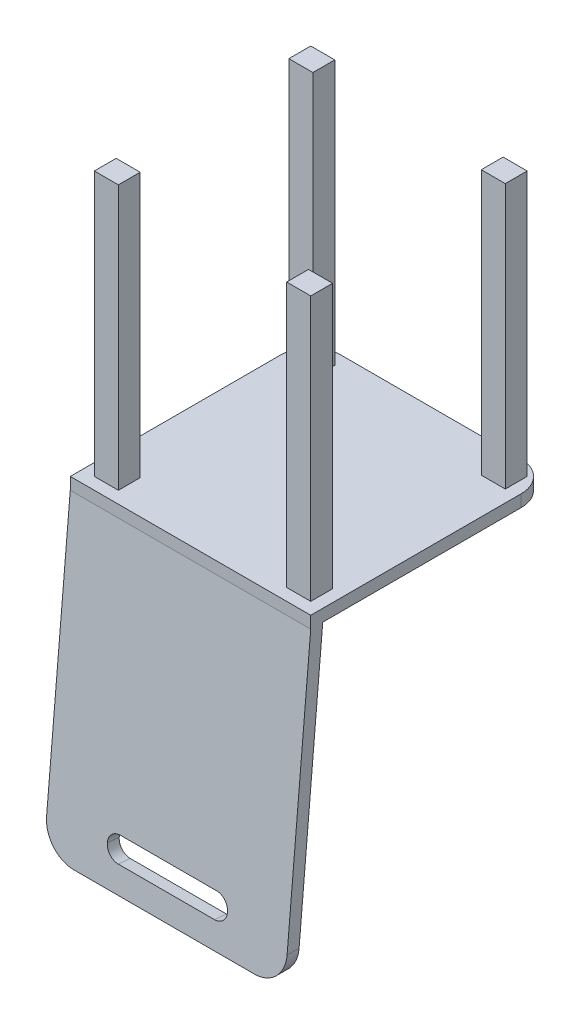
ISO-10303-21;
HEADER;
FILE_DESCRIPTION(('STEP AP214'),'2;1');
FILE_NAME('part.step','',(''),(''),'','','');
FILE_SCHEMA(('AUTOMOTIVE_DESIGN { 1 0 10303 214 1 1 1 1 }'));
ENDSEC;
DATA;
#1=APPLICATION_CONTEXT('core data for automotive mechanical design processes');
#2=APPLICATION_PROTOCOL_DEFINITION('international standard','automotive_design',2000,#1);
#3=PRODUCT_CONTEXT('',#1,'mechanical');
#4=PRODUCT('Part','Part','',(#3));
#5=PRODUCT_RELATED_PRODUCT_CATEGORY('part','',(#4));
#6=PRODUCT_DEFINITION_FORMATION('','',#4);
#7=PRODUCT_DEFINITION_CONTEXT('part definition',#1,'design');
#8=PRODUCT_DEFINITION('design','',#6,#7);
#9=PRODUCT_DEFINITION_SHAPE('','',#8);
#10=(LENGTH_UNIT() NAMED_UNIT(*) SI_UNIT(.MILLI.,.METRE.));
#11=(NAMED_UNIT(*) PLANE_ANGLE_UNIT() SI_UNIT($,.RADIAN.));
#12=(NAMED_UNIT(*) SI_UNIT($,.STERADIAN.) SOLID_ANGLE_UNIT());
#13=UNCERTAINTY_MEASURE_WITH_UNIT(LENGTH_MEASURE(1.E-05),#10,'distance_accuracy_value','');
#14=(GEOMETRIC_REPRESENTATION_CONTEXT(3) GLOBAL_UNCERTAINTY_ASSIGNED_CONTEXT((#13)) GLOBAL_UNIT_ASSIGNED_CONTEXT((#10,
#11,#12)) REPRESENTATION_CONTEXT('',''));
#15=CARTESIAN_POINT('',(0.,0.,0.));
#16=DIRECTION('',(0.,0.,1.));
#17=DIRECTION('',(1.,0.,0.));
#18=AXIS2_PLACEMENT_3D('',#15,#16,#17);
#19=CARTESIAN_POINT('',(0.,0.,0.));
#20=DIRECTION('',(0.,-1.,0.));
#21=DIRECTION('',(0.,0.,-1.));
#22=AXIS2_PLACEMENT_3D('',#19,#20,#21);
#23=PLANE('',#22);
#24=DIRECTION('',(-1.,0.,0.));
#25=VECTOR('',#24,1.);
#26=CARTESIAN_POINT('',(200.,0.,-200.));
#27=LINE('',#26,#25);
#28=CARTESIAN_POINT('',(150.,0.,-200.));
#29=VERTEX_POINT('',#28);
#30=CARTESIAN_POINT('',(-150.,0.,-200.));
#31=VERTEX_POINT('',#30);
#32=EDGE_CURVE('E283',#29,#31,#27,.T.);
#33=ORIENTED_EDGE('',*,*,#32,.F.);
#34=CARTESIAN_POINT('',(150.,0.,-150.));
#35=DIRECTION('',(0.,-1.,0.));
#36=DIRECTION('',(0.,0.,-1.));
#37=AXIS2_PLACEMENT_3D('',#34,#35,#36);
#38=CIRCLE('',#37,50.);
#39=CARTESIAN_POINT('',(200.,0.,-150.));
#40=VERTEX_POINT('',#39);
#41=EDGE_CURVE('E281',#29,#40,#38,.T.);
#42=ORIENTED_EDGE('',*,*,#41,.T.);
#43=DIRECTION('',(0.,0.,-1.));
#44=VECTOR('',#43,1.);
#45=CARTESIAN_POINT('',(200.,0.,-200.));
#46=LINE('',#45,#44);
#47=CARTESIAN_POINT('',(200.,0.,180.));
#48=VERTEX_POINT('',#47);
#49=EDGE_CURVE('E273',#48,#40,#46,.T.);
#50=ORIENTED_EDGE('',*,*,#49,.F.);
#51=DIRECTION('',(-1.,0.,0.));
#52=VECTOR('',#51,1.);
#53=CARTESIAN_POINT('',(200.,0.,180.));
#54=LINE('',#53,#52);
#55=CARTESIAN_POINT('',(-200.,0.,180.));
#56=VERTEX_POINT('',#55);
#57=EDGE_CURVE('E255',#48,#56,#54,.T.);
#58=ORIENTED_EDGE('',*,*,#57,.T.);
#59=DIRECTION('',(0.,0.,1.));
#60=VECTOR('',#59,1.);
#61=CARTESIAN_POINT('',(-200.,0.,-200.));
#62=LINE('',#61,#60);
#63=CARTESIAN_POINT('',(-200.,0.,-150.));
#64=VERTEX_POINT('',#63);
#65=EDGE_CURVE('E291',#64,#56,#62,.T.);
#66=ORIENTED_EDGE('',*,*,#65,.F.);
#67=CARTESIAN_POINT('',(-150.,0.,-150.));
#68=DIRECTION('',(0.,-1.,0.));
#69=DIRECTION('',(0.,0.,-1.));
#70=AXIS2_PLACEMENT_3D('',#67,#68,#69);
#71=CIRCLE('',#70,50.);
#72=EDGE_CURVE('E308',#64,#31,#71,.T.);
#73=ORIENTED_EDGE('',*,*,#72,.T.);
#74=EDGE_LOOP('',(#33,#42,#50,#58,#66,#73));
#75=FACE_BOUND('',#74,.T.);
#76=ADVANCED_FACE('F39',(#75),#23,.T.);
#77=CARTESIAN_POINT('',(0.,20.,0.));
#78=DIRECTION('',(0.,-1.,0.));
#79=DIRECTION('',(0.,0.,-1.));
#80=AXIS2_PLACEMENT_3D('',#77,#78,#79);
#81=PLANE('',#80);
#82=DIRECTION('',(0.,0.,-1.));
#83=VECTOR('',#82,1.);
#84=CARTESIAN_POINT('',(180.,20.,180.));
#85=LINE('',#84,#83);
#86=CARTESIAN_POINT('',(180.,20.,180.));
#87=VERTEX_POINT('',#86);
#88=CARTESIAN_POINT('',(180.,20.,143.629446770553));
#89=VERTEX_POINT('',#88);
#90=EDGE_CURVE('E481',#87,#89,#85,.T.);
#91=ORIENTED_EDGE('',*,*,#90,.F.);
#92=DIRECTION('',(1.,0.,0.));
#93=VECTOR('',#92,1.);
#94=CARTESIAN_POINT('',(180.,20.,180.));
#95=LINE('',#94,#93);
#96=CARTESIAN_POINT('',(140.,20.,180.));
#97=VERTEX_POINT('',#96);
#98=EDGE_CURVE('E487',#97,#87,#95,.T.);
#99=ORIENTED_EDGE('',*,*,#98,.F.);
#100=DIRECTION('',(0.,0.,1.));
#101=VECTOR('',#100,1.);
#102=CARTESIAN_POINT('',(140.,20.,180.));
#103=LINE('',#102,#101);
#104=CARTESIAN_POINT('',(140.,20.,143.629446770553));
#105=VERTEX_POINT('',#104);
#106=EDGE_CURVE('E504',#105,#97,#103,.T.);
#107=ORIENTED_EDGE('',*,*,#106,.F.);
#108=DIRECTION('',(-1.,0.,0.));
#109=VECTOR('',#108,1.);
#110=CARTESIAN_POINT('',(180.,20.,143.629446770553));
#111=LINE('',#110,#109);
#112=EDGE_CURVE('E500',#89,#105,#111,.T.);
#113=ORIENTED_EDGE('',*,*,#112,.F.);
#114=EDGE_LOOP('',(#91,#99,#107,#113));
#115=FACE_BOUND('',#114,.T.);
#116=DIRECTION('',(0.,0.,1.));
#117=VECTOR('',#116,1.);
#118=CARTESIAN_POINT('',(-180.,20.,-180.));
#119=LINE('',#118,#117);
#120=CARTESIAN_POINT('',(-180.,20.,-180.));
#121=VERTEX_POINT('',#120);
#122=CARTESIAN_POINT('',(-180.,20.,-143.629446770553));
#123=VERTEX_POINT('',#122);
#124=EDGE_CURVE('E571',#121,#123,#119,.T.);
#125=ORIENTED_EDGE('',*,*,#124,.F.);
#126=DIRECTION('',(-1.,0.,0.));
#127=VECTOR('',#126,1.);
#128=CARTESIAN_POINT('',(-180.,20.,-180.));
#129=LINE('',#128,#127);
#130=CARTESIAN_POINT('',(-140.,20.,-180.));
#131=VERTEX_POINT('',#130);
#132=EDGE_CURVE('E577',#131,#121,#129,.T.);
#133=ORIENTED_EDGE('',*,*,#132,.F.);
#134=DIRECTION('',(0.,0.,-1.));
#135=VECTOR('',#134,1.);
#136=CARTESIAN_POINT('',(-140.,20.,-180.));
#137=LINE('',#136,#135);
#138=CARTESIAN_POINT('',(-140.,20.,-143.629446770553));
#139=VERTEX_POINT('',#138);
#140=EDGE_CURVE('E594',#139,#131,#137,.T.);
#141=ORIENTED_EDGE('',*,*,#140,.F.);
#142=DIRECTION('',(1.,0.,0.));
#143=VECTOR('',#142,1.);
#144=CARTESIAN_POINT('',(-180.,20.,-143.629446770553));
#145=LINE('',#144,#143);
#146=EDGE_CURVE('E590',#123,#139,#145,.T.);
#147=ORIENTED_EDGE('',*,*,#146,.F.);
#148=EDGE_LOOP('',(#125,#133,#141,#147));
#149=FACE_BOUND('',#148,.T.);
#150=DIRECTION('',(0.,0.,-1.));
#151=VECTOR('',#150,1.);
#152=CARTESIAN_POINT('',(200.,20.,-200.));
#153=LINE('',#152,#151);
#154=CARTESIAN_POINT('',(200.,20.,200.));
#155=VERTEX_POINT('',#154);
#156=CARTESIAN_POINT('',(200.,20.,-150.));
#157=VERTEX_POINT('',#156);
#158=EDGE_CURVE('E621',#155,#157,#153,.T.);
#159=ORIENTED_EDGE('',*,*,#158,.T.);
#160=CARTESIAN_POINT('',(150.,20.,-150.));
#161=DIRECTION('',(0.,-1.,0.));
#162=DIRECTION('',(0.,0.,-1.));
#163=AXIS2_PLACEMENT_3D('',#160,#161,#162);
#164=CIRCLE('',#163,50.);
#165=CARTESIAN_POINT('',(150.,20.,-200.));
#166=VERTEX_POINT('',#165);
#167=EDGE_CURVE('E328',#157,#166,#164,.F.);
#168=ORIENTED_EDGE('',*,*,#167,.T.);
#169=DIRECTION('',(-1.,0.,0.));
#170=VECTOR('',#169,1.);
#171=CARTESIAN_POINT('',(200.,20.,-200.));
#172=LINE('',#171,#170);
#173=CARTESIAN_POINT('',(-150.,20.,-200.));
#174=VERTEX_POINT('',#173);
#175=EDGE_CURVE('E300',#166,#174,#172,.T.);
#176=ORIENTED_EDGE('',*,*,#175,.T.);
#177=CARTESIAN_POINT('',(-150.,20.,-150.));
#178=DIRECTION('',(0.,-1.,0.));
#179=DIRECTION('',(0.,0.,-1.));
#180=AXIS2_PLACEMENT_3D('',#177,#178,#179);
#181=CIRCLE('',#180,50.);
#182=CARTESIAN_POINT('',(-200.,20.,-150.));
#183=VERTEX_POINT('',#182);
#184=EDGE_CURVE('E316',#174,#183,#181,.F.);
#185=ORIENTED_EDGE('',*,*,#184,.T.);
#186=DIRECTION('',(0.,0.,1.));
#187=VECTOR('',#186,1.);
#188=CARTESIAN_POINT('',(-200.,20.,-200.));
#189=LINE('',#188,#187);
#190=CARTESIAN_POINT('',(-200.,20.,200.));
#191=VERTEX_POINT('',#190);
#192=EDGE_CURVE('E288',#183,#191,#189,.T.);
#193=ORIENTED_EDGE('',*,*,#192,.T.);
#194=DIRECTION('',(1.,0.,0.));
#195=VECTOR('',#194,1.);
#196=CARTESIAN_POINT('',(200.,20.,200.));
#197=LINE('',#196,#195);
#198=EDGE_CURVE('E618',#191,#155,#197,.T.);
#199=ORIENTED_EDGE('',*,*,#198,.T.);
#200=EDGE_LOOP('',(#159,#168,#176,#185,#193,#199));
#201=FACE_BOUND('',#200,.T.);
#202=DIRECTION('',(-1.,0.,0.));
#203=VECTOR('',#202,1.);
#204=CARTESIAN_POINT('',(180.,20.,-180.));
#205=LINE('',#204,#203);
#206=CARTESIAN_POINT('',(180.,20.,-180.));
#207=VERTEX_POINT('',#206);
#208=CARTESIAN_POINT('',(140.,20.,-180.));
#209=VERTEX_POINT('',#208);
#210=EDGE_CURVE('E526',#207,#209,#205,.T.);
#211=ORIENTED_EDGE('',*,*,#210,.F.);
#212=DIRECTION('',(0.,0.,-1.));
#213=VECTOR('',#212,1.);
#214=CARTESIAN_POINT('',(180.,20.,-180.));
#215=LINE('',#214,#213);
#216=CARTESIAN_POINT('',(180.,20.,-143.629446770553));
#217=VERTEX_POINT('',#216);
#218=EDGE_CURVE('E532',#217,#207,#215,.T.);
#219=ORIENTED_EDGE('',*,*,#218,.F.);
#220=DIRECTION('',(1.,0.,0.));
#221=VECTOR('',#220,1.);
#222=CARTESIAN_POINT('',(180.,20.,-143.629446770553));
#223=LINE('',#222,#221);
#224=CARTESIAN_POINT('',(140.,20.,-143.629446770553));
#225=VERTEX_POINT('',#224);
#226=EDGE_CURVE('E549',#225,#217,#223,.T.);
#227=ORIENTED_EDGE('',*,*,#226,.F.);
#228=DIRECTION('',(0.,0.,1.));
#229=VECTOR('',#228,1.);
#230=CARTESIAN_POINT('',(140.,20.,-180.));
#231=LINE('',#230,#229);
#232=EDGE_CURVE('E545',#209,#225,#231,.T.);
#233=ORIENTED_EDGE('',*,*,#232,.F.);
#234=EDGE_LOOP('',(#211,#219,#227,#233));
#235=FACE_BOUND('',#234,.T.);
#236=DIRECTION('',(1.,0.,0.));
#237=VECTOR('',#236,1.);
#238=CARTESIAN_POINT('',(-180.,20.,180.));
#239=LINE('',#238,#237);
#240=CARTESIAN_POINT('',(-180.,20.,180.));
#241=VERTEX_POINT('',#240);
#242=CARTESIAN_POINT('',(-140.,20.,180.));
#243=VERTEX_POINT('',#242);
#244=EDGE_CURVE('E434',#241,#243,#239,.T.);
#245=ORIENTED_EDGE('',*,*,#244,.F.);
#246=DIRECTION('',(0.,0.,1.));
#247=VECTOR('',#246,1.);
#248=CARTESIAN_POINT('',(-180.,20.,180.));
#249=LINE('',#248,#247);
#250=CARTESIAN_POINT('',(-180.,20.,143.629446770553));
#251=VERTEX_POINT('',#250);
#252=EDGE_CURVE('E442',#251,#241,#249,.T.);
#253=ORIENTED_EDGE('',*,*,#252,.F.);
#254=DIRECTION('',(-1.,0.,0.));
#255=VECTOR('',#254,1.);
#256=CARTESIAN_POINT('',(-180.,20.,143.629446770553));
#257=LINE('',#256,#255);
#258=CARTESIAN_POINT('',(-140.,20.,143.629446770553));
#259=VERTEX_POINT('',#258);
#260=EDGE_CURVE('E459',#259,#251,#257,.T.);
#261=ORIENTED_EDGE('',*,*,#260,.F.);
#262=DIRECTION('',(0.,0.,-1.));
#263=VECTOR('',#262,1.);
#264=CARTESIAN_POINT('',(-140.,20.,180.));
#265=LINE('',#264,#263);
#266=EDGE_CURVE('E455',#243,#259,#265,.T.);
#267=ORIENTED_EDGE('',*,*,#266,.F.);
#268=EDGE_LOOP('',(#245,#253,#261,#267));
#269=FACE_BOUND('',#268,.T.);
#270=ADVANCED_FACE('F645',(#115,#149,#201,#235,#269),#81,.F.);
#271=CARTESIAN_POINT('',(-200.,20.,-200.));
#272=DIRECTION('',(1.,0.,0.));
#273=DIRECTION('',(0.,0.,-1.));
#274=AXIS2_PLACEMENT_3D('',#271,#272,#273);
#275=PLANE('',#274);
#276=DIRECTION('',(0.,-0.996194698091745,0.0871557427476617));
#277=VECTOR('',#276,1.);
#278=CARTESIAN_POINT('',(-200.,-500.,223.744331762964));
#279=LINE('',#278,#277);
#280=CARTESIAN_POINT('',(-200.,-450.,219.369898586668));
#281=VERTEX_POINT('',#280);
#282=EDGE_CURVE('E261',#56,#281,#279,.T.);
#283=ORIENTED_EDGE('',*,*,#282,.T.);
#284=DIRECTION('',(0.,0.,1.));
#285=VECTOR('',#284,1.);
#286=CARTESIAN_POINT('',(-200.,-450.,243.744331762964));
#287=LINE('',#286,#285);
#288=CARTESIAN_POINT('',(-200.,-450.,239.369898586668));
#289=VERTEX_POINT('',#288);
#290=EDGE_CURVE('E331',#281,#289,#287,.T.);
#291=ORIENTED_EDGE('',*,*,#290,.T.);
#292=DIRECTION('',(0.,0.996194698091745,-0.0871557427476618));
#293=VECTOR('',#292,1.);
#294=CARTESIAN_POINT('',(-200.,0.,200.));
#295=LINE('',#294,#293);
#296=CARTESIAN_POINT('',(-200.,0.,200.));
#297=VERTEX_POINT('',#296);
#298=EDGE_CURVE('E278',#289,#297,#295,.T.);
#299=ORIENTED_EDGE('',*,*,#298,.T.);
#300=DIRECTION('',(0.,-1.,0.));
#301=VECTOR('',#300,1.);
#302=CARTESIAN_POINT('',(-200.,20.,200.));
#303=LINE('',#302,#301);
#304=EDGE_CURVE('E299',#191,#297,#303,.T.);
#305=ORIENTED_EDGE('',*,*,#304,.F.);
#306=ORIENTED_EDGE('',*,*,#192,.F.);
#307=DIRECTION('',(0.,-1.,0.));
#308=VECTOR('',#307,1.);
#309=CARTESIAN_POINT('',(-200.,20.,-150.));
#310=LINE('',#309,#308);
#311=EDGE_CURVE('E304',#183,#64,#310,.T.);
#312=ORIENTED_EDGE('',*,*,#311,.T.);
#313=ORIENTED_EDGE('',*,*,#65,.T.);
#314=EDGE_LOOP('',(#283,#291,#299,#305,#306,#312,#313));
#315=FACE_BOUND('',#314,.T.);
#316=ADVANCED_FACE('F628',(#315),#275,.F.);
#317=CARTESIAN_POINT('',(200.,20.,200.));
#318=DIRECTION('',(0.,0.,-1.));
#319=DIRECTION('',(-1.,0.,0.));
#320=AXIS2_PLACEMENT_3D('',#317,#318,#319);
#321=PLANE('',#320);
#322=DIRECTION('',(1.,0.,0.));
#323=VECTOR('',#322,1.);
#324=CARTESIAN_POINT('',(200.,0.,200.));
#325=LINE('',#324,#323);
#326=CARTESIAN_POINT('',(200.,0.,200.));
#327=VERTEX_POINT('',#326);
#328=EDGE_CURVE('E284',#297,#327,#325,.T.);
#329=ORIENTED_EDGE('',*,*,#328,.T.);
#330=DIRECTION('',(0.,-1.,0.));
#331=VECTOR('',#330,1.);
#332=CARTESIAN_POINT('',(200.,20.,200.));
#333=LINE('',#332,#331);
#334=EDGE_CURVE('E295',#155,#327,#333,.T.);
#335=ORIENTED_EDGE('',*,*,#334,.F.);
#336=ORIENTED_EDGE('',*,*,#198,.F.);
#337=ORIENTED_EDGE('',*,*,#304,.T.);
#338=EDGE_LOOP('',(#329,#335,#336,#337));
#339=FACE_BOUND('',#338,.T.);
#340=ADVANCED_FACE('F651',(#339),#321,.F.);
#341=CARTESIAN_POINT('',(200.,20.,-200.));
#342=DIRECTION('',(-1.,0.,0.));
#343=DIRECTION('',(0.,0.,1.));
#344=AXIS2_PLACEMENT_3D('',#341,#342,#343);
#345=PLANE('',#344);
#346=DIRECTION('',(0.,0.996194698091745,-0.0871557427476618));
#347=VECTOR('',#346,1.);
#348=CARTESIAN_POINT('',(200.,0.,200.));
#349=LINE('',#348,#347);
#350=CARTESIAN_POINT('',(200.,-450.,239.369898586668));
#351=VERTEX_POINT('',#350);
#352=EDGE_CURVE('E267',#351,#327,#349,.T.);
#353=ORIENTED_EDGE('',*,*,#352,.F.);
#354=DIRECTION('',(0.,0.,1.));
#355=VECTOR('',#354,1.);
#356=CARTESIAN_POINT('',(200.,-450.,223.744331762964));
#357=LINE('',#356,#355);
#358=CARTESIAN_POINT('',(200.,-450.,219.369898586668));
#359=VERTEX_POINT('',#358);
#360=EDGE_CURVE('E276',#351,#359,#357,.F.);
#361=ORIENTED_EDGE('',*,*,#360,.T.);
#362=DIRECTION('',(0.,-0.996194698091745,0.0871557427476617));
#363=VECTOR('',#362,1.);
#364=CARTESIAN_POINT('',(200.,-500.,223.744331762964));
#365=LINE('',#364,#363);
#366=EDGE_CURVE('E258',#48,#359,#365,.T.);
#367=ORIENTED_EDGE('',*,*,#366,.F.);
#368=ORIENTED_EDGE('',*,*,#49,.T.);
#369=DIRECTION('',(0.,-1.,0.));
#370=VECTOR('',#369,1.);
#371=CARTESIAN_POINT('',(200.,20.,-150.));
#372=LINE('',#371,#370);
#373=EDGE_CURVE('E325',#40,#157,#372,.F.);
#374=ORIENTED_EDGE('',*,*,#373,.T.);
#375=ORIENTED_EDGE('',*,*,#158,.F.);
#376=ORIENTED_EDGE('',*,*,#334,.T.);
#377=EDGE_LOOP('',(#353,#361,#367,#368,#374,#375,#376));
#378=FACE_BOUND('',#377,.T.);
#379=ADVANCED_FACE('F272',(#378),#345,.F.);
#380=CARTESIAN_POINT('',(200.,20.,-200.));
#381=DIRECTION('',(0.,0.,1.));
#382=DIRECTION('',(1.,0.,0.));
#383=AXIS2_PLACEMENT_3D('',#380,#381,#382);
#384=PLANE('',#383);
#385=ORIENTED_EDGE('',*,*,#175,.F.);
#386=DIRECTION('',(0.,-1.,0.));
#387=VECTOR('',#386,1.);
#388=CARTESIAN_POINT('',(150.,20.,-200.));
#389=LINE('',#388,#387);
#390=EDGE_CURVE('E319',#166,#29,#389,.T.);
#391=ORIENTED_EDGE('',*,*,#390,.T.);
#392=ORIENTED_EDGE('',*,*,#32,.T.);
#393=DIRECTION('',(0.,-1.,0.));
#394=VECTOR('',#393,1.);
#395=CARTESIAN_POINT('',(-150.,20.,-200.));
#396=LINE('',#395,#394);
#397=EDGE_CURVE('E312',#31,#174,#396,.F.);
#398=ORIENTED_EDGE('',*,*,#397,.T.);
#399=EDGE_LOOP('',(#385,#391,#392,#398));
#400=FACE_BOUND('',#399,.T.);
#401=ADVANCED_FACE('F638',(#400),#384,.F.);
#402=CARTESIAN_POINT('',(-180.,460.,-180.));
#403=DIRECTION('',(1.,0.,0.));
#404=DIRECTION('',(0.,0.,-1.));
#405=AXIS2_PLACEMENT_3D('',#402,#403,#404);
#406=PLANE('',#405);
#407=ORIENTED_EDGE('',*,*,#124,.T.);
#408=DIRECTION('',(0.,-1.,0.));
#409=VECTOR('',#408,1.);
#410=CARTESIAN_POINT('',(-180.,460.,-143.629446770553));
#411=LINE('',#410,#409);
#412=CARTESIAN_POINT('',(-180.,460.,-143.629446770553));
#413=VERTEX_POINT('',#412);
#414=EDGE_CURVE('E612',#413,#123,#411,.T.);
#415=ORIENTED_EDGE('',*,*,#414,.F.);
#416=DIRECTION('',(0.,0.,1.));
#417=VECTOR('',#416,1.);
#418=CARTESIAN_POINT('',(-180.,460.,-180.));
#419=LINE('',#418,#417);
#420=CARTESIAN_POINT('',(-180.,460.,-180.));
#421=VERTEX_POINT('',#420);
#422=EDGE_CURVE('E572',#421,#413,#419,.T.);
#423=ORIENTED_EDGE('',*,*,#422,.F.);
#424=DIRECTION('',(0.,-1.,0.));
#425=VECTOR('',#424,1.);
#426=CARTESIAN_POINT('',(-180.,460.,-180.));
#427=LINE('',#426,#425);
#428=EDGE_CURVE('E586',#421,#121,#427,.T.);
#429=ORIENTED_EDGE('',*,*,#428,.T.);
#430=EDGE_LOOP('',(#407,#415,#423,#429));
#431=FACE_BOUND('',#430,.T.);
#432=ADVANCED_FACE('F690',(#431),#406,.F.);
#433=CARTESIAN_POINT('',(-180.,460.,-143.629446770553));
#434=DIRECTION('',(0.,0.,-1.));
#435=DIRECTION('',(-1.,0.,0.));
#436=AXIS2_PLACEMENT_3D('',#433,#434,#435);
#437=PLANE('',#436);
#438=ORIENTED_EDGE('',*,*,#146,.T.);
#439=DIRECTION('',(0.,-1.,0.));
#440=VECTOR('',#439,1.);
#441=CARTESIAN_POINT('',(-140.,460.,-143.629446770553));
#442=LINE('',#441,#440);
#443=CARTESIAN_POINT('',(-140.,460.,-143.629446770553));
#444=VERTEX_POINT('',#443);
#445=EDGE_CURVE('E608',#444,#139,#442,.T.);
#446=ORIENTED_EDGE('',*,*,#445,.F.);
#447=DIRECTION('',(1.,0.,0.));
#448=VECTOR('',#447,1.);
#449=CARTESIAN_POINT('',(-180.,460.,-143.629446770553));
#450=LINE('',#449,#448);
#451=EDGE_CURVE('E576',#413,#444,#450,.T.);
#452=ORIENTED_EDGE('',*,*,#451,.F.);
#453=ORIENTED_EDGE('',*,*,#414,.T.);
#454=EDGE_LOOP('',(#438,#446,#452,#453));
#455=FACE_BOUND('',#454,.T.);
#456=ADVANCED_FACE('F1006',(#455),#437,.F.);
#457=CARTESIAN_POINT('',(-140.,460.,-180.));
#458=DIRECTION('',(-1.,0.,0.));
#459=DIRECTION('',(0.,0.,1.));
#460=AXIS2_PLACEMENT_3D('',#457,#458,#459);
#461=PLANE('',#460);
#462=ORIENTED_EDGE('',*,*,#140,.T.);
#463=DIRECTION('',(0.,-1.,0.));
#464=VECTOR('',#463,1.);
#465=CARTESIAN_POINT('',(-140.,460.,-180.));
#466=LINE('',#465,#464);
#467=CARTESIAN_POINT('',(-140.,460.,-180.));
#468=VERTEX_POINT('',#467);
#469=EDGE_CURVE('E604',#468,#131,#466,.T.);
#470=ORIENTED_EDGE('',*,*,#469,.F.);
#471=DIRECTION('',(0.,0.,-1.));
#472=VECTOR('',#471,1.);
#473=CARTESIAN_POINT('',(-140.,460.,-180.));
#474=LINE('',#473,#472);
#475=EDGE_CURVE('E580',#444,#468,#474,.T.);
#476=ORIENTED_EDGE('',*,*,#475,.F.);
#477=ORIENTED_EDGE('',*,*,#445,.T.);
#478=EDGE_LOOP('',(#462,#470,#476,#477));
#479=FACE_BOUND('',#478,.T.);
#480=ADVANCED_FACE('F996',(#479),#461,.F.);
#481=CARTESIAN_POINT('',(-180.,460.,-180.));
#482=DIRECTION('',(0.,0.,1.));
#483=DIRECTION('',(1.,0.,0.));
#484=AXIS2_PLACEMENT_3D('',#481,#482,#483);
#485=PLANE('',#484);
#486=ORIENTED_EDGE('',*,*,#132,.T.);
#487=ORIENTED_EDGE('',*,*,#428,.F.);
#488=DIRECTION('',(-1.,0.,0.));
#489=VECTOR('',#488,1.);
#490=CARTESIAN_POINT('',(-180.,460.,-180.));
#491=LINE('',#490,#489);
#492=EDGE_CURVE('E583',#468,#421,#491,.T.);
#493=ORIENTED_EDGE('',*,*,#492,.F.);
#494=ORIENTED_EDGE('',*,*,#469,.T.);
#495=EDGE_LOOP('',(#486,#487,#493,#494));
#496=FACE_BOUND('',#495,.T.);
#497=ADVANCED_FACE('F986',(#496),#485,.F.);
#498=CARTESIAN_POINT('',(0.,460.,0.));
#499=DIRECTION('',(0.,1.,0.));
#500=DIRECTION('',(0.,0.,1.));
#501=AXIS2_PLACEMENT_3D('',#498,#499,#500);
#502=PLANE('',#501);
#503=ORIENTED_EDGE('',*,*,#422,.T.);
#504=ORIENTED_EDGE('',*,*,#451,.T.);
#505=ORIENTED_EDGE('',*,*,#475,.T.);
#506=ORIENTED_EDGE('',*,*,#492,.T.);
#507=EDGE_LOOP('',(#503,#504,#505,#506));
#508=FACE_BOUND('',#507,.T.);
#509=ADVANCED_FACE('F976',(#508),#502,.T.);
#510=CARTESIAN_POINT('',(180.,460.,-180.));
#511=DIRECTION('',(0.,0.,1.));
#512=DIRECTION('',(1.,0.,0.));
#513=AXIS2_PLACEMENT_3D('',#510,#511,#512);
#514=PLANE('',#513);
#515=ORIENTED_EDGE('',*,*,#210,.T.);
#516=DIRECTION('',(0.,-1.,0.));
#517=VECTOR('',#516,1.);
#518=CARTESIAN_POINT('',(140.,460.,-180.));
#519=LINE('',#518,#517);
#520=CARTESIAN_POINT('',(140.,460.,-180.));
#521=VERTEX_POINT('',#520);
#522=EDGE_CURVE('E567',#521,#209,#519,.T.);
#523=ORIENTED_EDGE('',*,*,#522,.F.);
#524=DIRECTION('',(-1.,0.,0.));
#525=VECTOR('',#524,1.);
#526=CARTESIAN_POINT('',(180.,460.,-180.));
#527=LINE('',#526,#525);
#528=CARTESIAN_POINT('',(180.,460.,-180.));
#529=VERTEX_POINT('',#528);
#530=EDGE_CURVE('E527',#529,#521,#527,.T.);
#531=ORIENTED_EDGE('',*,*,#530,.F.);
#532=DIRECTION('',(0.,-1.,0.));
#533=VECTOR('',#532,1.);
#534=CARTESIAN_POINT('',(180.,460.,-180.));
#535=LINE('',#534,#533);
#536=EDGE_CURVE('E541',#529,#207,#535,.T.);
#537=ORIENTED_EDGE('',*,*,#536,.T.);
#538=EDGE_LOOP('',(#515,#523,#531,#537));
#539=FACE_BOUND('',#538,.T.);
#540=ADVANCED_FACE('F966',(#539),#514,.F.);
#541=CARTESIAN_POINT('',(140.,460.,-180.));
#542=DIRECTION('',(1.,0.,0.));
#543=DIRECTION('',(0.,0.,-1.));
#544=AXIS2_PLACEMENT_3D('',#541,#542,#543);
#545=PLANE('',#544);
#546=ORIENTED_EDGE('',*,*,#232,.T.);
#547=DIRECTION('',(0.,-1.,0.));
#548=VECTOR('',#547,1.);
#549=CARTESIAN_POINT('',(140.,460.,-143.629446770553));
#550=LINE('',#549,#548);
#551=CARTESIAN_POINT('',(140.,460.,-143.629446770553));
#552=VERTEX_POINT('',#551);
#553=EDGE_CURVE('E563',#552,#225,#550,.T.);
#554=ORIENTED_EDGE('',*,*,#553,.F.);
#555=DIRECTION('',(0.,0.,1.));
#556=VECTOR('',#555,1.);
#557=CARTESIAN_POINT('',(140.,460.,-180.));
#558=LINE('',#557,#556);
#559=EDGE_CURVE('E531',#521,#552,#558,.T.);
#560=ORIENTED_EDGE('',*,*,#559,.F.);
#561=ORIENTED_EDGE('',*,*,#522,.T.);
#562=EDGE_LOOP('',(#546,#554,#560,#561));
#563=FACE_BOUND('',#562,.T.);
#564=ADVANCED_FACE('F956',(#563),#545,.F.);
#565=CARTESIAN_POINT('',(180.,460.,-143.629446770553));
#566=DIRECTION('',(0.,0.,-1.));
#567=DIRECTION('',(-1.,0.,0.));
#568=AXIS2_PLACEMENT_3D('',#565,#566,#567);
#569=PLANE('',#568);
#570=ORIENTED_EDGE('',*,*,#226,.T.);
#571=DIRECTION('',(0.,-1.,0.));
#572=VECTOR('',#571,1.);
#573=CARTESIAN_POINT('',(180.,460.,-143.629446770553));
#574=LINE('',#573,#572);
#575=CARTESIAN_POINT('',(180.,460.,-143.629446770553));
#576=VERTEX_POINT('',#575);
#577=EDGE_CURVE('E559',#576,#217,#574,.T.);
#578=ORIENTED_EDGE('',*,*,#577,.F.);
#579=DIRECTION('',(1.,0.,0.));
#580=VECTOR('',#579,1.);
#581=CARTESIAN_POINT('',(180.,460.,-143.629446770553));
#582=LINE('',#581,#580);
#583=EDGE_CURVE('E535',#552,#576,#582,.T.);
#584=ORIENTED_EDGE('',*,*,#583,.F.);
#585=ORIENTED_EDGE('',*,*,#553,.T.);
#586=EDGE_LOOP('',(#570,#578,#584,#585));
#587=FACE_BOUND('',#586,.T.);
#588=ADVANCED_FACE('F946',(#587),#569,.F.);
#589=CARTESIAN_POINT('',(180.,460.,-180.));
#590=DIRECTION('',(-1.,0.,0.));
#591=DIRECTION('',(0.,0.,1.));
#592=AXIS2_PLACEMENT_3D('',#589,#590,#591);
#593=PLANE('',#592);
#594=ORIENTED_EDGE('',*,*,#218,.T.);
#595=ORIENTED_EDGE('',*,*,#536,.F.);
#596=DIRECTION('',(0.,0.,-1.));
#597=VECTOR('',#596,1.);
#598=CARTESIAN_POINT('',(180.,460.,-180.));
#599=LINE('',#598,#597);
#600=EDGE_CURVE('E538',#576,#529,#599,.T.);
#601=ORIENTED_EDGE('',*,*,#600,.F.);
#602=ORIENTED_EDGE('',*,*,#577,.T.);
#603=EDGE_LOOP('',(#594,#595,#601,#602));
#604=FACE_BOUND('',#603,.T.);
#605=ADVANCED_FACE('F936',(#604),#593,.F.);
#606=CARTESIAN_POINT('',(0.,460.,0.));
#607=DIRECTION('',(0.,1.,0.));
#608=DIRECTION('',(0.,0.,1.));
#609=AXIS2_PLACEMENT_3D('',#606,#607,#608);
#610=PLANE('',#609);
#611=ORIENTED_EDGE('',*,*,#530,.T.);
#612=ORIENTED_EDGE('',*,*,#559,.T.);
#613=ORIENTED_EDGE('',*,*,#583,.T.);
#614=ORIENTED_EDGE('',*,*,#600,.T.);
#615=EDGE_LOOP('',(#611,#612,#613,#614));
#616=FACE_BOUND('',#615,.T.);
#617=ADVANCED_FACE('F926',(#616),#610,.T.);
#618=CARTESIAN_POINT('',(180.,460.,180.));
#619=DIRECTION('',(-1.,0.,0.));
#620=DIRECTION('',(0.,0.,1.));
#621=AXIS2_PLACEMENT_3D('',#618,#619,#620);
#622=PLANE('',#621);
#623=ORIENTED_EDGE('',*,*,#90,.T.);
#624=DIRECTION('',(0.,-1.,0.));
#625=VECTOR('',#624,1.);
#626=CARTESIAN_POINT('',(180.,460.,143.629446770553));
#627=LINE('',#626,#625);
#628=CARTESIAN_POINT('',(180.,460.,143.629446770553));
#629=VERTEX_POINT('',#628);
#630=EDGE_CURVE('E522',#629,#89,#627,.T.);
#631=ORIENTED_EDGE('',*,*,#630,.F.);
#632=DIRECTION('',(0.,0.,-1.));
#633=VECTOR('',#632,1.);
#634=CARTESIAN_POINT('',(180.,460.,180.));
#635=LINE('',#634,#633);
#636=CARTESIAN_POINT('',(180.,460.,180.));
#637=VERTEX_POINT('',#636);
#638=EDGE_CURVE('E482',#637,#629,#635,.T.);
#639=ORIENTED_EDGE('',*,*,#638,.F.);
#640=DIRECTION('',(0.,-1.,0.));
#641=VECTOR('',#640,1.);
#642=CARTESIAN_POINT('',(180.,460.,180.));
#643=LINE('',#642,#641);
#644=EDGE_CURVE('E496',#637,#87,#643,.T.);
#645=ORIENTED_EDGE('',*,*,#644,.T.);
#646=EDGE_LOOP('',(#623,#631,#639,#645));
#647=FACE_BOUND('',#646,.T.);
#648=ADVANCED_FACE('F916',(#647),#622,.F.);
#649=CARTESIAN_POINT('',(180.,460.,143.629446770553));
#650=DIRECTION('',(0.,0.,1.));
#651=DIRECTION('',(1.,0.,0.));
#652=AXIS2_PLACEMENT_3D('',#649,#650,#651);
#653=PLANE('',#652);
#654=ORIENTED_EDGE('',*,*,#112,.T.);
#655=DIRECTION('',(0.,-1.,0.));
#656=VECTOR('',#655,1.);
#657=CARTESIAN_POINT('',(140.,460.,143.629446770553));
#658=LINE('',#657,#656);
#659=CARTESIAN_POINT('',(140.,460.,143.629446770553));
#660=VERTEX_POINT('',#659);
#661=EDGE_CURVE('E518',#660,#105,#658,.T.);
#662=ORIENTED_EDGE('',*,*,#661,.F.);
#663=DIRECTION('',(-1.,0.,0.));
#664=VECTOR('',#663,1.);
#665=CARTESIAN_POINT('',(180.,460.,143.629446770553));
#666=LINE('',#665,#664);
#667=EDGE_CURVE('E486',#629,#660,#666,.T.);
#668=ORIENTED_EDGE('',*,*,#667,.F.);
#669=ORIENTED_EDGE('',*,*,#630,.T.);
#670=EDGE_LOOP('',(#654,#662,#668,#669));
#671=FACE_BOUND('',#670,.T.);
#672=ADVANCED_FACE('F906',(#671),#653,.F.);
#673=CARTESIAN_POINT('',(140.,460.,180.));
#674=DIRECTION('',(1.,0.,0.));
#675=DIRECTION('',(0.,0.,-1.));
#676=AXIS2_PLACEMENT_3D('',#673,#674,#675);
#677=PLANE('',#676);
#678=ORIENTED_EDGE('',*,*,#106,.T.);
#679=DIRECTION('',(0.,-1.,0.));
#680=VECTOR('',#679,1.);
#681=CARTESIAN_POINT('',(140.,460.,180.));
#682=LINE('',#681,#680);
#683=CARTESIAN_POINT('',(140.,460.,180.));
#684=VERTEX_POINT('',#683);
#685=EDGE_CURVE('E514',#684,#97,#682,.T.);
#686=ORIENTED_EDGE('',*,*,#685,.F.);
#687=DIRECTION('',(0.,0.,1.));
#688=VECTOR('',#687,1.);
#689=CARTESIAN_POINT('',(140.,460.,180.));
#690=LINE('',#689,#688);
#691=EDGE_CURVE('E490',#660,#684,#690,.T.);
#692=ORIENTED_EDGE('',*,*,#691,.F.);
#693=ORIENTED_EDGE('',*,*,#661,.T.);
#694=EDGE_LOOP('',(#678,#686,#692,#693));
#695=FACE_BOUND('',#694,.T.);
#696=ADVANCED_FACE('F896',(#695),#677,.F.);
#697=CARTESIAN_POINT('',(180.,460.,180.));
#698=DIRECTION('',(0.,0.,-1.));
#699=DIRECTION('',(-1.,0.,0.));
#700=AXIS2_PLACEMENT_3D('',#697,#698,#699);
#701=PLANE('',#700);
#702=ORIENTED_EDGE('',*,*,#98,.T.);
#703=ORIENTED_EDGE('',*,*,#644,.F.);
#704=DIRECTION('',(1.,0.,0.));
#705=VECTOR('',#704,1.);
#706=CARTESIAN_POINT('',(180.,460.,180.));
#707=LINE('',#706,#705);
#708=EDGE_CURVE('E493',#684,#637,#707,.T.);
#709=ORIENTED_EDGE('',*,*,#708,.F.);
#710=ORIENTED_EDGE('',*,*,#685,.T.);
#711=EDGE_LOOP('',(#702,#703,#709,#710));
#712=FACE_BOUND('',#711,.T.);
#713=ADVANCED_FACE('F886',(#712),#701,.F.);
#714=CARTESIAN_POINT('',(0.,460.,0.));
#715=DIRECTION('',(0.,1.,0.));
#716=DIRECTION('',(0.,0.,1.));
#717=AXIS2_PLACEMENT_3D('',#714,#715,#716);
#718=PLANE('',#717);
#719=ORIENTED_EDGE('',*,*,#638,.T.);
#720=ORIENTED_EDGE('',*,*,#667,.T.);
#721=ORIENTED_EDGE('',*,*,#691,.T.);
#722=ORIENTED_EDGE('',*,*,#708,.T.);
#723=EDGE_LOOP('',(#719,#720,#721,#722));
#724=FACE_BOUND('',#723,.T.);
#725=ADVANCED_FACE('F876',(#724),#718,.T.);
#726=CARTESIAN_POINT('',(-180.,460.,180.));
#727=DIRECTION('',(0.,0.,-1.));
#728=DIRECTION('',(-1.,0.,0.));
#729=AXIS2_PLACEMENT_3D('',#726,#727,#728);
#730=PLANE('',#729);
#731=ORIENTED_EDGE('',*,*,#244,.T.);
#732=DIRECTION('',(0.,-1.,0.));
#733=VECTOR('',#732,1.);
#734=CARTESIAN_POINT('',(-140.,460.,180.));
#735=LINE('',#734,#733);
#736=CARTESIAN_POINT('',(-140.,460.,180.));
#737=VERTEX_POINT('',#736);
#738=EDGE_CURVE('E477',#737,#243,#735,.T.);
#739=ORIENTED_EDGE('',*,*,#738,.F.);
#740=DIRECTION('',(1.,0.,0.));
#741=VECTOR('',#740,1.);
#742=CARTESIAN_POINT('',(-180.,460.,180.));
#743=LINE('',#742,#741);
#744=CARTESIAN_POINT('',(-180.,460.,180.));
#745=VERTEX_POINT('',#744);
#746=EDGE_CURVE('E437',#745,#737,#743,.T.);
#747=ORIENTED_EDGE('',*,*,#746,.F.);
#748=DIRECTION('',(0.,-1.,0.));
#749=VECTOR('',#748,1.);
#750=CARTESIAN_POINT('',(-180.,460.,180.));
#751=LINE('',#750,#749);
#752=EDGE_CURVE('E451',#745,#241,#751,.T.);
#753=ORIENTED_EDGE('',*,*,#752,.T.);
#754=EDGE_LOOP('',(#731,#739,#747,#753));
#755=FACE_BOUND('',#754,.T.);
#756=ADVANCED_FACE('F866',(#755),#730,.F.);
#757=CARTESIAN_POINT('',(-140.,460.,180.));
#758=DIRECTION('',(-1.,0.,0.));
#759=DIRECTION('',(0.,0.,1.));
#760=AXIS2_PLACEMENT_3D('',#757,#758,#759);
#761=PLANE('',#760);
#762=ORIENTED_EDGE('',*,*,#266,.T.);
#763=DIRECTION('',(0.,-1.,0.));
#764=VECTOR('',#763,1.);
#765=CARTESIAN_POINT('',(-140.,460.,143.629446770553));
#766=LINE('',#765,#764);
#767=CARTESIAN_POINT('',(-140.,460.,143.629446770553));
#768=VERTEX_POINT('',#767);
#769=EDGE_CURVE('E473',#768,#259,#766,.T.);
#770=ORIENTED_EDGE('',*,*,#769,.F.);
#771=DIRECTION('',(0.,0.,-1.));
#772=VECTOR('',#771,1.);
#773=CARTESIAN_POINT('',(-140.,460.,180.));
#774=LINE('',#773,#772);
#775=EDGE_CURVE('E441',#737,#768,#774,.T.);
#776=ORIENTED_EDGE('',*,*,#775,.F.);
#777=ORIENTED_EDGE('',*,*,#738,.T.);
#778=EDGE_LOOP('',(#762,#770,#776,#777));
#779=FACE_BOUND('',#778,.T.);
#780=ADVANCED_FACE('F856',(#779),#761,.F.);
#781=CARTESIAN_POINT('',(-180.,460.,143.629446770553));
#782=DIRECTION('',(0.,0.,1.));
#783=DIRECTION('',(1.,0.,0.));
#784=AXIS2_PLACEMENT_3D('',#781,#782,#783);
#785=PLANE('',#784);
#786=ORIENTED_EDGE('',*,*,#260,.T.);
#787=DIRECTION('',(0.,-1.,0.));
#788=VECTOR('',#787,1.);
#789=CARTESIAN_POINT('',(-180.,460.,143.629446770553));
#790=LINE('',#789,#788);
#791=CARTESIAN_POINT('',(-180.,460.,143.629446770553));
#792=VERTEX_POINT('',#791);
#793=EDGE_CURVE('E469',#792,#251,#790,.T.);
#794=ORIENTED_EDGE('',*,*,#793,.F.);
#795=DIRECTION('',(-1.,0.,0.));
#796=VECTOR('',#795,1.);
#797=CARTESIAN_POINT('',(-180.,460.,143.629446770553));
#798=LINE('',#797,#796);
#799=EDGE_CURVE('E445',#768,#792,#798,.T.);
#800=ORIENTED_EDGE('',*,*,#799,.F.);
#801=ORIENTED_EDGE('',*,*,#769,.T.);
#802=EDGE_LOOP('',(#786,#794,#800,#801));
#803=FACE_BOUND('',#802,.T.);
#804=ADVANCED_FACE('F846',(#803),#785,.F.);
#805=CARTESIAN_POINT('',(-180.,460.,180.));
#806=DIRECTION('',(1.,0.,0.));
#807=DIRECTION('',(0.,0.,-1.));
#808=AXIS2_PLACEMENT_3D('',#805,#806,#807);
#809=PLANE('',#808);
#810=ORIENTED_EDGE('',*,*,#252,.T.);
#811=ORIENTED_EDGE('',*,*,#752,.F.);
#812=DIRECTION('',(0.,0.,1.));
#813=VECTOR('',#812,1.);
#814=CARTESIAN_POINT('',(-180.,460.,180.));
#815=LINE('',#814,#813);
#816=EDGE_CURVE('E448',#792,#745,#815,.T.);
#817=ORIENTED_EDGE('',*,*,#816,.F.);
#818=ORIENTED_EDGE('',*,*,#793,.T.);
#819=EDGE_LOOP('',(#810,#811,#817,#818));
#820=FACE_BOUND('',#819,.T.);
#821=ADVANCED_FACE('F675',(#820),#809,.F.);
#822=CARTESIAN_POINT('',(0.,460.,0.));
#823=DIRECTION('',(0.,1.,0.));
#824=DIRECTION('',(0.,0.,1.));
#825=AXIS2_PLACEMENT_3D('',#822,#823,#824);
#826=PLANE('',#825);
#827=ORIENTED_EDGE('',*,*,#746,.T.);
#828=ORIENTED_EDGE('',*,*,#775,.T.);
#829=ORIENTED_EDGE('',*,*,#799,.T.);
#830=ORIENTED_EDGE('',*,*,#816,.T.);
#831=EDGE_LOOP('',(#827,#828,#829,#830));
#832=FACE_BOUND('',#831,.T.);
#833=ADVANCED_FACE('F668',(#832),#826,.T.);
#834=CARTESIAN_POINT('',(200.,0.,200.));
#835=DIRECTION('',(0.,0.0871557427476618,0.996194698091745));
#836=DIRECTION('',(0.,-0.996194698091745,0.0871557427476618));
#837=AXIS2_PLACEMENT_3D('',#834,#835,#836);
#838=PLANE('',#837);
#839=CARTESIAN_POINT('',(-80.,-438.491836337826,238.363064728226));
#840=DIRECTION('',(0.,0.0871557427476618,0.996194698091745));
#841=DIRECTION('',(0.,-0.996194698091745,0.0871557427476618));
#842=AXIS2_PLACEMENT_3D('',#839,#840,#841);
#843=CIRCLE('',#842,20.);
#844=CARTESIAN_POINT('',(-80.,-458.415730299661,240.10617958318));
#845=VERTEX_POINT('',#844);
#846=CARTESIAN_POINT('',(-100.,-438.491836337826,238.363064728226));
#847=VERTEX_POINT('',#846);
#848=EDGE_CURVE('E393',#845,#847,#843,.F.);
#849=ORIENTED_EDGE('',*,*,#848,.T.);
#850=CARTESIAN_POINT('',(-80.,-438.491836337826,238.363064728226));
#851=DIRECTION('',(0.,0.0871557427476618,0.996194698091745));
#852=DIRECTION('',(0.,-0.996194698091745,0.0871557427476618));
#853=AXIS2_PLACEMENT_3D('',#850,#851,#852);
#854=CIRCLE('',#853,20.);
#855=CARTESIAN_POINT('',(-80.,-418.567942375991,236.619949873273));
#856=VERTEX_POINT('',#855);
#857=EDGE_CURVE('E11',#847,#856,#854,.F.);
#858=ORIENTED_EDGE('',*,*,#857,.T.);
#859=DIRECTION('',(-1.,0.,0.));
#860=VECTOR('',#859,1.);
#861=CARTESIAN_POINT('',(200.,-418.567942375991,236.619949873273));
#862=LINE('',#861,#860);
#863=CARTESIAN_POINT('',(80.,-418.567942375991,236.619949873273));
#864=VERTEX_POINT('',#863);
#865=EDGE_CURVE('E412',#864,#856,#862,.T.);
#866=ORIENTED_EDGE('',*,*,#865,.F.);
#867=CARTESIAN_POINT('',(80.,-438.491836337826,238.363064728226));
#868=DIRECTION('',(0.,0.0871557427476618,0.996194698091745));
#869=DIRECTION('',(0.,-0.996194698091745,0.0871557427476618));
#870=AXIS2_PLACEMENT_3D('',#867,#868,#869);
#871=CIRCLE('',#870,20.);
#872=CARTESIAN_POINT('',(100.,-438.491836337826,238.363064728226));
#873=VERTEX_POINT('',#872);
#874=EDGE_CURVE('E381',#864,#873,#871,.F.);
#875=ORIENTED_EDGE('',*,*,#874,.T.);
#876=CARTESIAN_POINT('',(80.,-438.491836337826,238.363064728226));
#877=DIRECTION('',(0.,0.0871557427476618,0.996194698091745));
#878=DIRECTION('',(0.,-0.996194698091745,0.0871557427476618));
#879=AXIS2_PLACEMENT_3D('',#876,#877,#878);
#880=CIRCLE('',#879,20.);
#881=CARTESIAN_POINT('',(80.,-458.415730299661,240.10617958318));
#882=VERTEX_POINT('',#881);
#883=EDGE_CURVE('E370',#873,#882,#880,.F.);
#884=ORIENTED_EDGE('',*,*,#883,.T.);
#885=DIRECTION('',(1.,0.,0.));
#886=VECTOR('',#885,1.);
#887=CARTESIAN_POINT('',(200.,-458.415730299661,240.10617958318));
#888=LINE('',#887,#886);
#889=EDGE_CURVE('E416',#845,#882,#888,.T.);
#890=ORIENTED_EDGE('',*,*,#889,.F.);
#891=EDGE_LOOP('',(#849,#858,#866,#875,#884,#890));
#892=FACE_BOUND('',#891,.T.);
#893=DIRECTION('',(-1.,0.,0.));
#894=VECTOR('',#893,1.);
#895=CARTESIAN_POINT('',(200.,-500.,243.744331762964));
#896=LINE('',#895,#894);
#897=CARTESIAN_POINT('',(150.,-500.,243.744331762964));
#898=VERTEX_POINT('',#897);
#899=CARTESIAN_POINT('',(-150.,-500.,243.744331762964));
#900=VERTEX_POINT('',#899);
#901=EDGE_CURVE('E431',#898,#900,#896,.T.);
#902=ORIENTED_EDGE('',*,*,#901,.F.);
#903=CARTESIAN_POINT('',(150.,-450.,239.369898586668));
#904=DIRECTION('',(0.,0.0871557427476618,0.996194698091745));
#905=DIRECTION('',(0.,0.996194698091745,-0.0871557427476618));
#906=AXIS2_PLACEMENT_3D('',#903,#904,#905);
#907=ELLIPSE('',#906,50.1909918771674,50.);
#908=EDGE_CURVE('E350',#898,#351,#907,.T.);
#909=ORIENTED_EDGE('',*,*,#908,.T.);
#910=ORIENTED_EDGE('',*,*,#352,.T.);
#911=ORIENTED_EDGE('',*,*,#328,.F.);
#912=ORIENTED_EDGE('',*,*,#298,.F.);
#913=CARTESIAN_POINT('',(-150.,-450.,239.369898586667));
#914=DIRECTION('',(0.,0.0871557427476618,0.996194698091745));
#915=DIRECTION('',(0.,0.996194698091745,-0.0871557427476618));
#916=AXIS2_PLACEMENT_3D('',#913,#914,#915);
#917=ELLIPSE('',#916,50.1909918771674,50.);
#918=EDGE_CURVE('E335',#289,#900,#917,.T.);
#919=ORIENTED_EDGE('',*,*,#918,.T.);
#920=EDGE_LOOP('',(#902,#909,#910,#911,#912,#919));
#921=FACE_BOUND('',#920,.T.);
#922=ADVANCED_FACE('F666',(#892,#921),#838,.T.);
#923=CARTESIAN_POINT('',(200.,-500.,243.744331762964));
#924=DIRECTION('',(0.,-1.,0.));
#925=DIRECTION('',(0.,0.,-1.));
#926=AXIS2_PLACEMENT_3D('',#923,#924,#925);
#927=PLANE('',#926);
#928=DIRECTION('',(-1.,0.,0.));
#929=VECTOR('',#928,1.);
#930=CARTESIAN_POINT('',(200.,-500.,223.744331762964));
#931=LINE('',#930,#929);
#932=CARTESIAN_POINT('',(150.,-500.,223.744331762964));
#933=VERTEX_POINT('',#932);
#934=CARTESIAN_POINT('',(-150.,-500.,223.744331762964));
#935=VERTEX_POINT('',#934);
#936=EDGE_CURVE('E266',#933,#935,#931,.T.);
#937=ORIENTED_EDGE('',*,*,#936,.F.);
#938=DIRECTION('',(0.,0.,1.));
#939=VECTOR('',#938,1.);
#940=CARTESIAN_POINT('',(150.,-500.,243.744331762964));
#941=LINE('',#940,#939);
#942=EDGE_CURVE('E346',#933,#898,#941,.T.);
#943=ORIENTED_EDGE('',*,*,#942,.T.);
#944=ORIENTED_EDGE('',*,*,#901,.T.);
#945=DIRECTION('',(0.,0.,1.));
#946=VECTOR('',#945,1.);
#947=CARTESIAN_POINT('',(-150.,-500.,223.744331762964));
#948=LINE('',#947,#946);
#949=EDGE_CURVE('E339',#900,#935,#948,.F.);
#950=ORIENTED_EDGE('',*,*,#949,.T.);
#951=EDGE_LOOP('',(#937,#943,#944,#950));
#952=FACE_BOUND('',#951,.T.);
#953=ADVANCED_FACE('F659',(#952),#927,.T.);
#954=CARTESIAN_POINT('',(200.,-500.,223.744331762964));
#955=DIRECTION('',(0.,-0.0871557427476617,-0.996194698091745));
#956=DIRECTION('',(0.,0.996194698091745,-0.0871557427476617));
#957=AXIS2_PLACEMENT_3D('',#954,#955,#956);
#958=PLANE('',#957);
#959=DIRECTION('',(1.,0.,0.));
#960=VECTOR('',#959,1.);
#961=CARTESIAN_POINT('',(-100.,-420.304424152661,216.771872343151));
#962=LINE('',#961,#960);
#963=CARTESIAN_POINT('',(-80.,-420.304424152661,216.771872343151));
#964=VERTEX_POINT('',#963);
#965=CARTESIAN_POINT('',(80.,-420.304424152661,216.771872343151));
#966=VERTEX_POINT('',#965);
#967=EDGE_CURVE('E404',#964,#966,#962,.T.);
#968=ORIENTED_EDGE('',*,*,#967,.F.);
#969=CARTESIAN_POINT('',(-80.,-440.228318114496,218.514987198104));
#970=DIRECTION('',(0.,-0.0871557427476617,-0.996194698091745));
#971=DIRECTION('',(0.,0.996194698091745,-0.0871557427476617));
#972=AXIS2_PLACEMENT_3D('',#969,#970,#971);
#973=CIRCLE('',#972,20.);
#974=CARTESIAN_POINT('',(-100.,-440.228318114495,218.514987198104));
#975=VERTEX_POINT('',#974);
#976=EDGE_CURVE('E48',#964,#975,#973,.F.);
#977=ORIENTED_EDGE('',*,*,#976,.T.);
#978=CARTESIAN_POINT('',(-80.,-440.228318114495,218.514987198104));
#979=DIRECTION('',(0.,-0.0871557427476617,-0.996194698091745));
#980=DIRECTION('',(0.,0.996194698091745,-0.0871557427476617));
#981=AXIS2_PLACEMENT_3D('',#978,#979,#980);
#982=CIRCLE('',#981,20.);
#983=CARTESIAN_POINT('',(-80.,-460.15221207633,220.258102053057));
#984=VERTEX_POINT('',#983);
#985=EDGE_CURVE('E390',#975,#984,#982,.F.);
#986=ORIENTED_EDGE('',*,*,#985,.T.);
#987=DIRECTION('',(-1.,0.,0.));
#988=VECTOR('',#987,1.);
#989=CARTESIAN_POINT('',(-100.,-460.15221207633,220.258102053057));
#990=LINE('',#989,#988);
#991=CARTESIAN_POINT('',(80.,-460.15221207633,220.258102053057));
#992=VERTEX_POINT('',#991);
#993=EDGE_CURVE('E417',#992,#984,#990,.T.);
#994=ORIENTED_EDGE('',*,*,#993,.F.);
#995=CARTESIAN_POINT('',(80.,-440.228318114495,218.514987198104));
#996=DIRECTION('',(0.,-0.0871557427476617,-0.996194698091745));
#997=DIRECTION('',(0.,0.996194698091745,-0.0871557427476617));
#998=AXIS2_PLACEMENT_3D('',#995,#996,#997);
#999=CIRCLE('',#998,20.);
#1000=CARTESIAN_POINT('',(100.,-440.228318114495,218.514987198104));
#1001=VERTEX_POINT('',#1000);
#1002=EDGE_CURVE('E366',#992,#1001,#999,.F.);
#1003=ORIENTED_EDGE('',*,*,#1002,.T.);
#1004=CARTESIAN_POINT('',(80.,-440.228318114496,218.514987198104));
#1005=DIRECTION('',(0.,-0.0871557427476617,-0.996194698091745));
#1006=DIRECTION('',(0.,0.996194698091745,-0.0871557427476617));
#1007=AXIS2_PLACEMENT_3D('',#1004,#1005,#1006);
#1008=CIRCLE('',#1007,20.);
#1009=EDGE_CURVE('E377',#1001,#966,#1008,.F.);
#1010=ORIENTED_EDGE('',*,*,#1009,.T.);
#1011=EDGE_LOOP('',(#968,#977,#986,#994,#1003,#1010));
#1012=FACE_BOUND('',#1011,.T.);
#1013=ORIENTED_EDGE('',*,*,#366,.T.);
#1014=CARTESIAN_POINT('',(150.,-450.,219.369898586668));
#1015=DIRECTION('',(0.,-0.0871557427476617,-0.996194698091745));
#1016=DIRECTION('',(0.,0.996194698091745,-0.0871557427476617));
#1017=AXIS2_PLACEMENT_3D('',#1014,#1015,#1016);
#1018=ELLIPSE('',#1017,50.1909918771674,50.);
#1019=EDGE_CURVE('E355',#359,#933,#1018,.T.);
#1020=ORIENTED_EDGE('',*,*,#1019,.T.);
#1021=ORIENTED_EDGE('',*,*,#936,.T.);
#1022=CARTESIAN_POINT('',(-150.,-450.,219.369898586667));
#1023=DIRECTION('',(0.,-0.0871557427476617,-0.996194698091745));
#1024=DIRECTION('',(0.,0.996194698091745,-0.0871557427476617));
#1025=AXIS2_PLACEMENT_3D('',#1022,#1023,#1024);
#1026=ELLIPSE('',#1025,50.1909918771674,50.);
#1027=EDGE_CURVE('E343',#935,#281,#1026,.T.);
#1028=ORIENTED_EDGE('',*,*,#1027,.T.);
#1029=ORIENTED_EDGE('',*,*,#282,.F.);
#1030=ORIENTED_EDGE('',*,*,#57,.F.);
#1031=EDGE_LOOP('',(#1013,#1020,#1021,#1028,#1029,#1030));
#1032=FACE_BOUND('',#1031,.T.);
#1033=ADVANCED_FACE('F257',(#1012,#1032),#958,.T.);
#1034=CARTESIAN_POINT('',(-150.,20.,-150.));
#1035=DIRECTION('',(0.,-1.,0.));
#1036=DIRECTION('',(0.,0.,-1.));
#1037=AXIS2_PLACEMENT_3D('',#1034,#1035,#1036);
#1038=CYLINDRICAL_SURFACE('',#1037,50.);
#1039=ORIENTED_EDGE('',*,*,#184,.F.);
#1040=ORIENTED_EDGE('',*,*,#397,.F.);
#1041=ORIENTED_EDGE('',*,*,#72,.F.);
#1042=ORIENTED_EDGE('',*,*,#311,.F.);
#1043=EDGE_LOOP('',(#1039,#1040,#1041,#1042));
#1044=FACE_BOUND('',#1043,.T.);
#1045=ADVANCED_FACE('F635',(#1044),#1038,.T.);
#1046=CARTESIAN_POINT('',(150.,20.,-150.));
#1047=DIRECTION('',(0.,-1.,0.));
#1048=DIRECTION('',(0.,0.,-1.));
#1049=AXIS2_PLACEMENT_3D('',#1046,#1047,#1048);
#1050=CYLINDRICAL_SURFACE('',#1049,50.);
#1051=ORIENTED_EDGE('',*,*,#167,.F.);
#1052=ORIENTED_EDGE('',*,*,#373,.F.);
#1053=ORIENTED_EDGE('',*,*,#41,.F.);
#1054=ORIENTED_EDGE('',*,*,#390,.F.);
#1055=EDGE_LOOP('',(#1051,#1052,#1053,#1054));
#1056=FACE_BOUND('',#1055,.T.);
#1057=ADVANCED_FACE('F642',(#1056),#1050,.T.);
#1058=CARTESIAN_POINT('',(-150.,-450.,-200.));
#1059=DIRECTION('',(0.,0.,-1.));
#1060=DIRECTION('',(-1.,0.,0.));
#1061=AXIS2_PLACEMENT_3D('',#1058,#1059,#1060);
#1062=CYLINDRICAL_SURFACE('',#1061,50.);
#1063=ORIENTED_EDGE('',*,*,#1027,.F.);
#1064=ORIENTED_EDGE('',*,*,#949,.F.);
#1065=ORIENTED_EDGE('',*,*,#918,.F.);
#1066=ORIENTED_EDGE('',*,*,#290,.F.);
#1067=EDGE_LOOP('',(#1063,#1064,#1065,#1066));
#1068=FACE_BOUND('',#1067,.T.);
#1069=ADVANCED_FACE('F664',(#1068),#1062,.T.);
#1070=CARTESIAN_POINT('',(150.,-450.,243.744331762964));
#1071=DIRECTION('',(0.,0.,-1.));
#1072=DIRECTION('',(-1.,0.,0.));
#1073=AXIS2_PLACEMENT_3D('',#1070,#1071,#1072);
#1074=CYLINDRICAL_SURFACE('',#1073,50.);
#1075=ORIENTED_EDGE('',*,*,#1019,.F.);
#1076=ORIENTED_EDGE('',*,*,#360,.F.);
#1077=ORIENTED_EDGE('',*,*,#908,.F.);
#1078=ORIENTED_EDGE('',*,*,#942,.F.);
#1079=EDGE_LOOP('',(#1075,#1076,#1077,#1078));
#1080=FACE_BOUND('',#1079,.T.);
#1081=ADVANCED_FACE('F655',(#1080),#1074,.T.);
#1082=CARTESIAN_POINT('',(-100.,-425.289914977266,618.735981289756));
#1083=DIRECTION('',(0.,-0.996194698091745,0.0871557427476617));
#1084=DIRECTION('',(0.,-0.0871557427476617,-0.996194698091745));
#1085=AXIS2_PLACEMENT_3D('',#1082,#1083,#1084);
#1086=PLANE('',#1085);
#1087=ORIENTED_EDGE('',*,*,#993,.T.);
#1088=DIRECTION('',(0.,-0.0871557427476617,-0.996194698091745));
#1089=VECTOR('',#1088,1.);
#1090=CARTESIAN_POINT('',(-80.,-458.415730299661,240.106179583179));
#1091=LINE('',#1090,#1089);
#1092=EDGE_CURVE('E387',#984,#845,#1091,.F.);
#1093=ORIENTED_EDGE('',*,*,#1092,.T.);
#1094=ORIENTED_EDGE('',*,*,#889,.T.);
#1095=DIRECTION('',(0.,-0.0871557427476617,-0.996194698091745));
#1096=VECTOR('',#1095,1.);
#1097=CARTESIAN_POINT('',(80.,-460.15221207633,220.258102053057));
#1098=LINE('',#1097,#1096);
#1099=EDGE_CURVE('E358',#882,#992,#1098,.T.);
#1100=ORIENTED_EDGE('',*,*,#1099,.T.);
#1101=EDGE_LOOP('',(#1087,#1093,#1094,#1100));
#1102=FACE_BOUND('',#1101,.T.);
#1103=ADVANCED_FACE('F705',(#1102),#1086,.F.);
#1104=CARTESIAN_POINT('',(-100.,-385.442127053596,615.249751579849));
#1105=DIRECTION('',(0.,0.996194698091745,-0.0871557427476617));
#1106=DIRECTION('',(0.,0.0871557427476617,0.996194698091745));
#1107=AXIS2_PLACEMENT_3D('',#1104,#1105,#1106);
#1108=PLANE('',#1107);
#1109=ORIENTED_EDGE('',*,*,#865,.T.);
#1110=DIRECTION('',(0.,-0.0871557427476617,-0.996194698091745));
#1111=VECTOR('',#1110,1.);
#1112=CARTESIAN_POINT('',(-80.,-420.304424152661,216.771872343151));
#1113=LINE('',#1112,#1111);
#1114=EDGE_CURVE('E396',#856,#964,#1113,.T.);
#1115=ORIENTED_EDGE('',*,*,#1114,.T.);
#1116=ORIENTED_EDGE('',*,*,#967,.T.);
#1117=DIRECTION('',(0.,-0.0871557427476617,-0.996194698091745));
#1118=VECTOR('',#1117,1.);
#1119=CARTESIAN_POINT('',(80.,-418.567942375991,236.619949873273));
#1120=LINE('',#1119,#1118);
#1121=EDGE_CURVE('E374',#966,#864,#1120,.F.);
#1122=ORIENTED_EDGE('',*,*,#1121,.T.);
#1123=EDGE_LOOP('',(#1109,#1115,#1116,#1122));
#1124=FACE_BOUND('',#1123,.T.);
#1125=ADVANCED_FACE('F411',(#1124),#1108,.F.);
#1126=CARTESIAN_POINT('',(80.,-405.366021015431,616.992866434802));
#1127=DIRECTION('',(0.,0.0871557427476617,0.996194698091745));
#1128=DIRECTION('',(0.,-0.996194698091745,0.0871557427476617));
#1129=AXIS2_PLACEMENT_3D('',#1126,#1127,#1128);
#1130=CYLINDRICAL_SURFACE('',#1129,20.);
#1131=ORIENTED_EDGE('',*,*,#883,.F.);
#1132=DIRECTION('',(0.,-0.0871557427476617,-0.996194698091745));
#1133=VECTOR('',#1132,1.);
#1134=CARTESIAN_POINT('',(100.,-438.491836337826,238.363064728226));
#1135=LINE('',#1134,#1133);
#1136=EDGE_CURVE('E362',#1001,#873,#1135,.F.);
#1137=ORIENTED_EDGE('',*,*,#1136,.F.);
#1138=ORIENTED_EDGE('',*,*,#1002,.F.);
#1139=ORIENTED_EDGE('',*,*,#1099,.F.);
#1140=EDGE_LOOP('',(#1131,#1137,#1138,#1139));
#1141=FACE_BOUND('',#1140,.T.);
#1142=ADVANCED_FACE('F706',(#1141),#1130,.F.);
#1143=CARTESIAN_POINT('',(80.,-405.366021015431,616.992866434802));
#1144=DIRECTION('',(0.,0.0871557427476617,0.996194698091745));
#1145=DIRECTION('',(0.,-0.996194698091745,0.0871557427476617));
#1146=AXIS2_PLACEMENT_3D('',#1143,#1144,#1145);
#1147=CYLINDRICAL_SURFACE('',#1146,20.);
#1148=ORIENTED_EDGE('',*,*,#874,.F.);
#1149=ORIENTED_EDGE('',*,*,#1121,.F.);
#1150=ORIENTED_EDGE('',*,*,#1009,.F.);
#1151=ORIENTED_EDGE('',*,*,#1136,.T.);
#1152=EDGE_LOOP('',(#1148,#1149,#1150,#1151));
#1153=FACE_BOUND('',#1152,.T.);
#1154=ADVANCED_FACE('F709',(#1153),#1147,.F.);
#1155=CARTESIAN_POINT('',(-80.,-405.366021015431,616.992866434802));
#1156=DIRECTION('',(0.,0.0871557427476617,0.996194698091745));
#1157=DIRECTION('',(0.,-0.996194698091745,0.0871557427476617));
#1158=AXIS2_PLACEMENT_3D('',#1155,#1156,#1157);
#1159=CYLINDRICAL_SURFACE('',#1158,20.);
#1160=ORIENTED_EDGE('',*,*,#848,.F.);
#1161=ORIENTED_EDGE('',*,*,#1092,.F.);
#1162=ORIENTED_EDGE('',*,*,#985,.F.);
#1163=DIRECTION('',(0.,-0.0871557427476617,-0.996194698091745));
#1164=VECTOR('',#1163,1.);
#1165=CARTESIAN_POINT('',(-100.,-440.228318114495,218.514987198104));
#1166=LINE('',#1165,#1164);
#1167=EDGE_CURVE('E384',#847,#975,#1166,.T.);
#1168=ORIENTED_EDGE('',*,*,#1167,.F.);
#1169=EDGE_LOOP('',(#1160,#1161,#1162,#1168));
#1170=FACE_BOUND('',#1169,.T.);
#1171=ADVANCED_FACE('F409',(#1170),#1159,.F.);
#1172=CARTESIAN_POINT('',(-80.,-405.366021015431,616.992866434802));
#1173=DIRECTION('',(0.,0.0871557427476617,0.996194698091745));
#1174=DIRECTION('',(0.,-0.996194698091745,0.0871557427476617));
#1175=AXIS2_PLACEMENT_3D('',#1172,#1173,#1174);
#1176=CYLINDRICAL_SURFACE('',#1175,20.);
#1177=ORIENTED_EDGE('',*,*,#857,.F.);
#1178=ORIENTED_EDGE('',*,*,#1167,.T.);
#1179=ORIENTED_EDGE('',*,*,#976,.F.);
#1180=ORIENTED_EDGE('',*,*,#1114,.F.);
#1181=EDGE_LOOP('',(#1177,#1178,#1179,#1180));
#1182=FACE_BOUND('',#1181,.T.);
#1183=ADVANCED_FACE('F41',(#1182),#1176,.F.);
#1184=CLOSED_SHELL('',(#76,#270,#316,#340,#379,#401,#432,#456,#480,#497,#509,#540,#564,#588,
#605,#617,#648,#672,#696,#713,#725,#756,#780,#804,#821,#833,#922,#953,#1033,#1045,#1057,#1069,
#1081,#1103,#1125,#1142,#1154,#1171,#1183));
#1185=MANIFOLD_SOLID_BREP('B2',#1184);
#1186=ADVANCED_BREP_SHAPE_REPRESENTATION('',(#18,#1185),#14);
#1187=SHAPE_DEFINITION_REPRESENTATION(#9,#1186);
ENDSEC;
END-ISO-10303-21;
